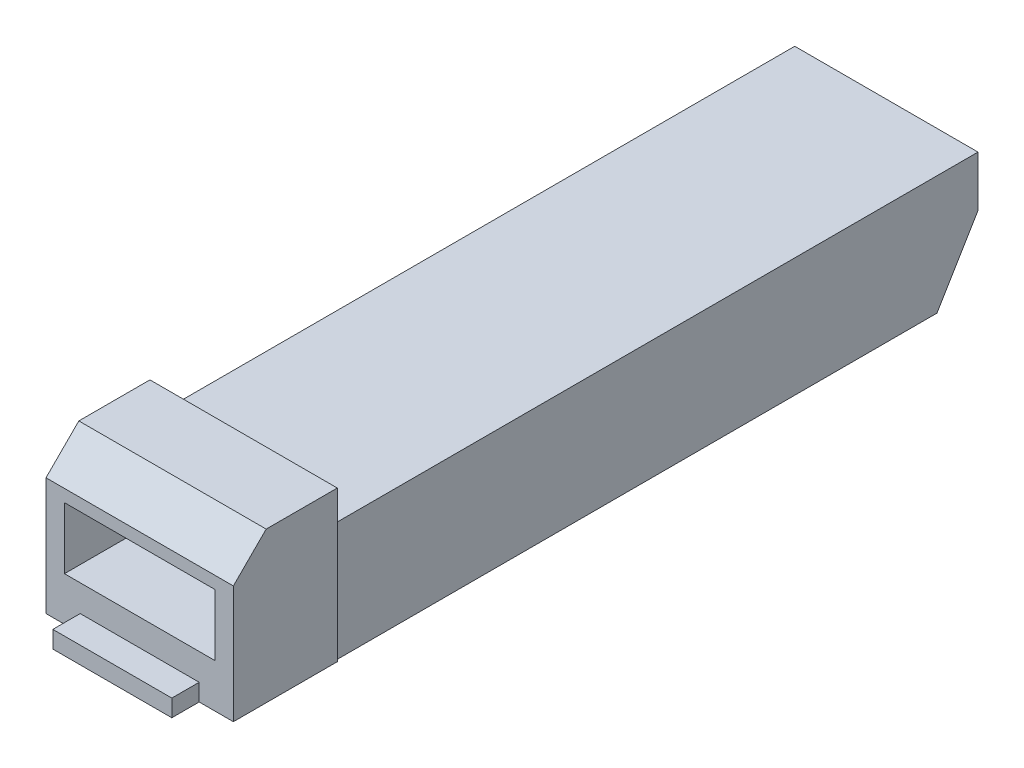
ISO-10303-21;
HEADER;
FILE_DESCRIPTION(('STEP AP214'),'2;1');
FILE_NAME('part.step','',(''),(''),'','','');
FILE_SCHEMA(('AUTOMOTIVE_DESIGN { 1 0 10303 214 1 1 1 1 }'));
ENDSEC;
DATA;
#1=APPLICATION_CONTEXT('core data for automotive mechanical design processes');
#2=APPLICATION_PROTOCOL_DEFINITION('international standard','automotive_design',2000,#1);
#3=PRODUCT_CONTEXT('',#1,'mechanical');
#4=PRODUCT('Part','Part','',(#3));
#5=PRODUCT_RELATED_PRODUCT_CATEGORY('part','',(#4));
#6=PRODUCT_DEFINITION_FORMATION('','',#4);
#7=PRODUCT_DEFINITION_CONTEXT('part definition',#1,'design');
#8=PRODUCT_DEFINITION('design','',#6,#7);
#9=PRODUCT_DEFINITION_SHAPE('','',#8);
#10=(LENGTH_UNIT() NAMED_UNIT(*) SI_UNIT(.MILLI.,.METRE.));
#11=(NAMED_UNIT(*) PLANE_ANGLE_UNIT() SI_UNIT($,.RADIAN.));
#12=(NAMED_UNIT(*) SI_UNIT($,.STERADIAN.) SOLID_ANGLE_UNIT());
#13=UNCERTAINTY_MEASURE_WITH_UNIT(LENGTH_MEASURE(1.E-05),#10,'distance_accuracy_value','');
#14=(GEOMETRIC_REPRESENTATION_CONTEXT(3) GLOBAL_UNCERTAINTY_ASSIGNED_CONTEXT((#13)) GLOBAL_UNIT_ASSIGNED_CONTEXT((#10,
#11,#12)) REPRESENTATION_CONTEXT('',''));
#15=CARTESIAN_POINT('',(0.,0.,0.));
#16=DIRECTION('',(0.,0.,1.));
#17=DIRECTION('',(1.,0.,0.));
#18=AXIS2_PLACEMENT_3D('',#15,#16,#17);
#19=CARTESIAN_POINT('',(4.35,0.,39.6297865460114));
#20=DIRECTION('',(-1.,0.,0.));
#21=DIRECTION('',(0.,0.,1.));
#22=AXIS2_PLACEMENT_3D('',#19,#20,#21);
#23=PLANE('',#22);
#24=DIRECTION('',(0.,1.,0.));
#25=VECTOR('',#24,1.);
#26=CARTESIAN_POINT('',(4.35,0.,37.6297865460114));
#27=LINE('',#26,#25);
#28=CARTESIAN_POINT('',(4.35,0.,37.6297865460114));
#29=VERTEX_POINT('',#28);
#30=CARTESIAN_POINT('',(4.35,1.25,37.6297865460114));
#31=VERTEX_POINT('',#30);
#32=EDGE_CURVE('E105',#29,#31,#27,.T.);
#33=ORIENTED_EDGE('',*,*,#32,.T.);
#34=DIRECTION('',(0.,0.,-1.));
#35=VECTOR('',#34,1.);
#36=CARTESIAN_POINT('',(4.35,1.25,39.6297865460114));
#37=LINE('',#36,#35);
#38=CARTESIAN_POINT('',(4.35,1.25,39.6297865460114));
#39=VERTEX_POINT('',#38);
#40=EDGE_CURVE('E12',#39,#31,#37,.T.);
#41=ORIENTED_EDGE('',*,*,#40,.F.);
#42=DIRECTION('',(0.,1.,0.));
#43=VECTOR('',#42,1.);
#44=CARTESIAN_POINT('',(4.35,0.,39.6297865460114));
#45=LINE('',#44,#43);
#46=CARTESIAN_POINT('',(4.35,0.,39.6297865460114));
#47=VERTEX_POINT('',#46);
#48=EDGE_CURVE('E93',#47,#39,#45,.T.);
#49=ORIENTED_EDGE('',*,*,#48,.F.);
#50=DIRECTION('',(0.,0.,-1.));
#51=VECTOR('',#50,1.);
#52=CARTESIAN_POINT('',(4.35,0.,39.6297865460114));
#53=LINE('',#52,#51);
#54=EDGE_CURVE('E101',#47,#29,#53,.T.);
#55=ORIENTED_EDGE('',*,*,#54,.T.);
#56=EDGE_LOOP('',(#33,#41,#49,#55));
#57=FACE_BOUND('',#56,.T.);
#58=ADVANCED_FACE('F42',(#57),#23,.F.);
#59=CARTESIAN_POINT('',(4.35,1.25,39.6297865460114));
#60=DIRECTION('',(0.,-1.,0.));
#61=DIRECTION('',(0.,0.,-1.));
#62=AXIS2_PLACEMENT_3D('',#59,#60,#61);
#63=PLANE('',#62);
#64=DIRECTION('',(-1.,0.,0.));
#65=VECTOR('',#64,1.);
#66=CARTESIAN_POINT('',(4.35,1.25,37.6297865460114));
#67=LINE('',#66,#65);
#68=CARTESIAN_POINT('',(-4.35,1.25,37.6297865460114));
#69=VERTEX_POINT('',#68);
#70=EDGE_CURVE('E97',#31,#69,#67,.T.);
#71=ORIENTED_EDGE('',*,*,#70,.T.);
#72=DIRECTION('',(0.,0.,-1.));
#73=VECTOR('',#72,1.);
#74=CARTESIAN_POINT('',(-4.35,1.25,39.6297865460114));
#75=LINE('',#74,#73);
#76=CARTESIAN_POINT('',(-4.35,1.25,39.6297865460114));
#77=VERTEX_POINT('',#76);
#78=EDGE_CURVE('E50',#77,#69,#75,.T.);
#79=ORIENTED_EDGE('',*,*,#78,.F.);
#80=DIRECTION('',(-1.,0.,0.));
#81=VECTOR('',#80,1.);
#82=CARTESIAN_POINT('',(4.35,1.25,39.6297865460114));
#83=LINE('',#82,#81);
#84=EDGE_CURVE('E88',#39,#77,#83,.T.);
#85=ORIENTED_EDGE('',*,*,#84,.F.);
#86=ORIENTED_EDGE('',*,*,#40,.T.);
#87=EDGE_LOOP('',(#71,#79,#85,#86));
#88=FACE_BOUND('',#87,.T.);
#89=ADVANCED_FACE('F96',(#88),#63,.F.);
#90=CARTESIAN_POINT('',(-4.35,0.,39.6297865460114));
#91=DIRECTION('',(1.,0.,0.));
#92=DIRECTION('',(0.,0.,-1.));
#93=AXIS2_PLACEMENT_3D('',#90,#91,#92);
#94=PLANE('',#93);
#95=DIRECTION('',(0.,-1.,0.));
#96=VECTOR('',#95,1.);
#97=CARTESIAN_POINT('',(-4.35,0.,37.6297865460114));
#98=LINE('',#97,#96);
#99=CARTESIAN_POINT('',(-4.35,0.,37.6297865460114));
#100=VERTEX_POINT('',#99);
#101=EDGE_CURVE('E75',#69,#100,#98,.T.);
#102=ORIENTED_EDGE('',*,*,#101,.T.);
#103=DIRECTION('',(0.,0.,-1.));
#104=VECTOR('',#103,1.);
#105=CARTESIAN_POINT('',(-4.35,0.,39.6297865460114));
#106=LINE('',#105,#104);
#107=CARTESIAN_POINT('',(-4.35,0.,39.6297865460114));
#108=VERTEX_POINT('',#107);
#109=EDGE_CURVE('E98',#108,#100,#106,.T.);
#110=ORIENTED_EDGE('',*,*,#109,.F.);
#111=DIRECTION('',(0.,-1.,0.));
#112=VECTOR('',#111,1.);
#113=CARTESIAN_POINT('',(-4.35,0.,39.6297865460114));
#114=LINE('',#113,#112);
#115=EDGE_CURVE('E91',#77,#108,#114,.T.);
#116=ORIENTED_EDGE('',*,*,#115,.F.);
#117=ORIENTED_EDGE('',*,*,#78,.T.);
#118=EDGE_LOOP('',(#102,#110,#116,#117));
#119=FACE_BOUND('',#118,.T.);
#120=ADVANCED_FACE('F99',(#119),#94,.F.);
#121=CARTESIAN_POINT('',(4.35,0.,39.6297865460114));
#122=DIRECTION('',(0.,1.,0.));
#123=DIRECTION('',(0.,0.,1.));
#124=AXIS2_PLACEMENT_3D('',#121,#122,#123);
#125=PLANE('',#124);
#126=DIRECTION('',(1.,0.,0.));
#127=VECTOR('',#126,1.);
#128=CARTESIAN_POINT('',(4.35,0.,37.6297865460114));
#129=LINE('',#128,#127);
#130=EDGE_CURVE('E81',#100,#29,#129,.T.);
#131=ORIENTED_EDGE('',*,*,#130,.T.);
#132=ORIENTED_EDGE('',*,*,#54,.F.);
#133=DIRECTION('',(1.,0.,0.));
#134=VECTOR('',#133,1.);
#135=CARTESIAN_POINT('',(4.35,0.,39.6297865460114));
#136=LINE('',#135,#134);
#137=EDGE_CURVE('E58',#108,#47,#136,.T.);
#138=ORIENTED_EDGE('',*,*,#137,.F.);
#139=ORIENTED_EDGE('',*,*,#109,.T.);
#140=EDGE_LOOP('',(#131,#132,#138,#139));
#141=FACE_BOUND('',#140,.T.);
#142=ADVANCED_FACE('F112',(#141),#125,.F.);
#143=CARTESIAN_POINT('',(0.,0.,39.6297865460114));
#144=DIRECTION('',(0.,0.,1.));
#145=DIRECTION('',(1.,0.,0.));
#146=AXIS2_PLACEMENT_3D('',#143,#144,#145);
#147=PLANE('',#146);
#148=ORIENTED_EDGE('',*,*,#48,.T.);
#149=ORIENTED_EDGE('',*,*,#84,.T.);
#150=ORIENTED_EDGE('',*,*,#115,.T.);
#151=ORIENTED_EDGE('',*,*,#137,.T.);
#152=EDGE_LOOP('',(#148,#149,#150,#151));
#153=FACE_BOUND('',#152,.T.);
#154=ADVANCED_FACE('F89',(#153),#147,.T.);
#155=CARTESIAN_POINT('',(0.,0.,37.6297865460114));
#156=DIRECTION('',(0.,0.,1.));
#157=DIRECTION('',(1.,0.,0.));
#158=AXIS2_PLACEMENT_3D('',#155,#156,#157);
#159=PLANE('',#158);
#160=ORIENTED_EDGE('',*,*,#32,.F.);
#161=ORIENTED_EDGE('',*,*,#130,.F.);
#162=ORIENTED_EDGE('',*,*,#101,.F.);
#163=ORIENTED_EDGE('',*,*,#70,.F.);
#164=EDGE_LOOP('',(#160,#161,#162,#163));
#165=FACE_BOUND('',#164,.T.);
#166=ADVANCED_FACE('F115',(#165),#159,.F.);
#167=CLOSED_SHELL('',(#58,#89,#120,#142,#154,#166));
#168=MANIFOLD_SOLID_BREP('B2',#167);
#169=CARTESIAN_POINT('',(-6.70000000000001,8.7,-16.9702134539886));
#170=DIRECTION('',(1.,0.,0.));
#171=DIRECTION('',(0.,0.,-1.));
#172=AXIS2_PLACEMENT_3D('',#169,#170,#171);
#173=PLANE('',#172);
#174=DIRECTION('',(0.,-1.,0.));
#175=VECTOR('',#174,1.);
#176=CARTESIAN_POINT('',(-6.70000000000001,8.7,-16.9702134539886));
#177=LINE('',#176,#175);
#178=CARTESIAN_POINT('',(-6.70000000000001,8.7,-16.9702134539886));
#179=VERTEX_POINT('',#178);
#180=CARTESIAN_POINT('',(-6.7,5.,-16.9702134539886));
#181=VERTEX_POINT('',#180);
#182=EDGE_CURVE('E388',#179,#181,#177,.T.);
#183=ORIENTED_EDGE('',*,*,#182,.T.);
#184=DIRECTION('',(0.,0.857492925712544,-0.514495755427526));
#185=VECTOR('',#184,1.);
#186=CARTESIAN_POINT('',(-6.7,0.,-13.9702134539886));
#187=LINE('',#186,#185);
#188=CARTESIAN_POINT('',(-6.7,0.,-13.9702134539886));
#189=VERTEX_POINT('',#188);
#190=EDGE_CURVE('E333',#189,#181,#187,.T.);
#191=ORIENTED_EDGE('',*,*,#190,.F.);
#192=DIRECTION('',(0.,0.,1.));
#193=VECTOR('',#192,1.);
#194=CARTESIAN_POINT('',(-6.70000000000001,0.,-16.9702134539886));
#195=LINE('',#194,#193);
#196=CARTESIAN_POINT('',(-6.7,0.,30.0297865460114));
#197=VERTEX_POINT('',#196);
#198=EDGE_CURVE('E367',#189,#197,#195,.T.);
#199=ORIENTED_EDGE('',*,*,#198,.T.);
#200=DIRECTION('',(0.,-1.,0.));
#201=VECTOR('',#200,1.);
#202=CARTESIAN_POINT('',(-6.7,8.7,30.0297865460114));
#203=LINE('',#202,#201);
#204=CARTESIAN_POINT('',(-6.7,8.7,30.0297865460114));
#205=VERTEX_POINT('',#204);
#206=EDGE_CURVE('E172',#205,#197,#203,.T.);
#207=ORIENTED_EDGE('',*,*,#206,.F.);
#208=DIRECTION('',(0.,0.,1.));
#209=VECTOR('',#208,1.);
#210=CARTESIAN_POINT('',(-6.70000000000001,8.7,-16.9702134539886));
#211=LINE('',#210,#209);
#212=EDGE_CURVE('E366',#179,#205,#211,.T.);
#213=ORIENTED_EDGE('',*,*,#212,.F.);
#214=EDGE_LOOP('',(#183,#191,#199,#207,#213));
#215=FACE_BOUND('',#214,.T.);
#216=ADVANCED_FACE('F165',(#215),#173,.F.);
#217=CARTESIAN_POINT('',(6.69999999999999,8.7,-16.9702134539886));
#218=DIRECTION('',(-1.,0.,0.));
#219=DIRECTION('',(0.,0.,1.));
#220=AXIS2_PLACEMENT_3D('',#217,#218,#219);
#221=PLANE('',#220);
#222=DIRECTION('',(0.,0.,-1.));
#223=VECTOR('',#222,1.);
#224=CARTESIAN_POINT('',(6.69999999999999,0.,-16.9702134539886));
#225=LINE('',#224,#223);
#226=CARTESIAN_POINT('',(6.7,0.,30.0297865460114));
#227=VERTEX_POINT('',#226);
#228=CARTESIAN_POINT('',(6.69999999999999,0.,-13.9702134539886));
#229=VERTEX_POINT('',#228);
#230=EDGE_CURVE('E362',#227,#229,#225,.T.);
#231=ORIENTED_EDGE('',*,*,#230,.T.);
#232=DIRECTION('',(0.,0.857492925712544,-0.514495755427526));
#233=VECTOR('',#232,1.);
#234=CARTESIAN_POINT('',(6.7,0.,-13.9702134539886));
#235=LINE('',#234,#233);
#236=CARTESIAN_POINT('',(6.7,5.,-16.9702134539886));
#237=VERTEX_POINT('',#236);
#238=EDGE_CURVE('E397',#229,#237,#235,.T.);
#239=ORIENTED_EDGE('',*,*,#238,.T.);
#240=DIRECTION('',(0.,-1.,0.));
#241=VECTOR('',#240,1.);
#242=CARTESIAN_POINT('',(6.69999999999999,8.7,-16.9702134539886));
#243=LINE('',#242,#241);
#244=CARTESIAN_POINT('',(6.69999999999999,8.7,-16.9702134539886));
#245=VERTEX_POINT('',#244);
#246=EDGE_CURVE('E379',#245,#237,#243,.T.);
#247=ORIENTED_EDGE('',*,*,#246,.F.);
#248=DIRECTION('',(0.,0.,-1.));
#249=VECTOR('',#248,1.);
#250=CARTESIAN_POINT('',(6.69999999999999,8.7,-16.9702134539886));
#251=LINE('',#250,#249);
#252=CARTESIAN_POINT('',(6.7,8.7,30.0297865460114));
#253=VERTEX_POINT('',#252);
#254=EDGE_CURVE('E393',#253,#245,#251,.T.);
#255=ORIENTED_EDGE('',*,*,#254,.F.);
#256=DIRECTION('',(0.,-1.,0.));
#257=VECTOR('',#256,1.);
#258=CARTESIAN_POINT('',(6.7,8.7,30.0297865460114));
#259=LINE('',#258,#257);
#260=EDGE_CURVE('E377',#253,#227,#259,.T.);
#261=ORIENTED_EDGE('',*,*,#260,.T.);
#262=EDGE_LOOP('',(#231,#239,#247,#255,#261));
#263=FACE_BOUND('',#262,.T.);
#264=ADVANCED_FACE('F401',(#263),#221,.F.);
#265=CARTESIAN_POINT('',(-6.70000000000001,8.7,-16.9702134539886));
#266=DIRECTION('',(0.,0.,1.));
#267=DIRECTION('',(1.,0.,0.));
#268=AXIS2_PLACEMENT_3D('',#265,#266,#267);
#269=PLANE('',#268);
#270=ORIENTED_EDGE('',*,*,#246,.T.);
#271=DIRECTION('',(-1.,0.,0.));
#272=VECTOR('',#271,1.);
#273=CARTESIAN_POINT('',(6.7,5.,-16.9702134539886));
#274=LINE('',#273,#272);
#275=EDGE_CURVE('E371',#237,#181,#274,.T.);
#276=ORIENTED_EDGE('',*,*,#275,.T.);
#277=ORIENTED_EDGE('',*,*,#182,.F.);
#278=DIRECTION('',(-1.,0.,0.));
#279=VECTOR('',#278,1.);
#280=CARTESIAN_POINT('',(-6.70000000000001,8.7,-16.9702134539886));
#281=LINE('',#280,#279);
#282=EDGE_CURVE('E391',#245,#179,#281,.T.);
#283=ORIENTED_EDGE('',*,*,#282,.F.);
#284=EDGE_LOOP('',(#270,#276,#277,#283));
#285=FACE_BOUND('',#284,.T.);
#286=ADVANCED_FACE('F406',(#285),#269,.F.);
#287=CARTESIAN_POINT('',(0.,8.7,0.));
#288=DIRECTION('',(0.,1.,0.));
#289=DIRECTION('',(0.,0.,1.));
#290=AXIS2_PLACEMENT_3D('',#287,#288,#289);
#291=PLANE('',#290);
#292=ORIENTED_EDGE('',*,*,#212,.T.);
#293=DIRECTION('',(1.,0.,0.));
#294=VECTOR('',#293,1.);
#295=CARTESIAN_POINT('',(-6.7,8.7,30.0297865460114));
#296=LINE('',#295,#294);
#297=EDGE_CURVE('E369',#205,#253,#296,.T.);
#298=ORIENTED_EDGE('',*,*,#297,.T.);
#299=ORIENTED_EDGE('',*,*,#254,.T.);
#300=ORIENTED_EDGE('',*,*,#282,.T.);
#301=EDGE_LOOP('',(#292,#298,#299,#300));
#302=FACE_BOUND('',#301,.T.);
#303=ADVANCED_FACE('F410',(#302),#291,.T.);
#304=CARTESIAN_POINT('',(0.,0.,0.));
#305=DIRECTION('',(0.,1.,0.));
#306=DIRECTION('',(0.,0.,1.));
#307=AXIS2_PLACEMENT_3D('',#304,#305,#306);
#308=PLANE('',#307);
#309=ORIENTED_EDGE('',*,*,#198,.F.);
#310=DIRECTION('',(-1.,0.,0.));
#311=VECTOR('',#310,1.);
#312=CARTESIAN_POINT('',(6.7,0.,-13.9702134539886));
#313=LINE('',#312,#311);
#314=EDGE_CURVE('E363',#229,#189,#313,.T.);
#315=ORIENTED_EDGE('',*,*,#314,.F.);
#316=ORIENTED_EDGE('',*,*,#230,.F.);
#317=DIRECTION('',(1.,0.,0.));
#318=VECTOR('',#317,1.);
#319=CARTESIAN_POINT('',(-6.85,0.,30.0297865460114));
#320=LINE('',#319,#318);
#321=CARTESIAN_POINT('',(6.85,0.,30.0297865460114));
#322=VERTEX_POINT('',#321);
#323=EDGE_CURVE('E318',#227,#322,#320,.T.);
#324=ORIENTED_EDGE('',*,*,#323,.T.);
#325=DIRECTION('',(0.,0.,-1.));
#326=VECTOR('',#325,1.);
#327=CARTESIAN_POINT('',(6.85,0.,37.6297865460114));
#328=LINE('',#327,#326);
#329=CARTESIAN_POINT('',(6.85,0.,37.6297865460114));
#330=VERTEX_POINT('',#329);
#331=EDGE_CURVE('E334',#330,#322,#328,.T.);
#332=ORIENTED_EDGE('',*,*,#331,.F.);
#333=DIRECTION('',(1.,0.,0.));
#334=VECTOR('',#333,1.);
#335=CARTESIAN_POINT('',(-6.85,0.,37.6297865460114));
#336=LINE('',#335,#334);
#337=CARTESIAN_POINT('',(-6.85,0.,37.6297865460114));
#338=VERTEX_POINT('',#337);
#339=EDGE_CURVE('E309',#338,#330,#336,.T.);
#340=ORIENTED_EDGE('',*,*,#339,.F.);
#341=DIRECTION('',(0.,0.,-1.));
#342=VECTOR('',#341,1.);
#343=CARTESIAN_POINT('',(-6.85,0.,37.6297865460114));
#344=LINE('',#343,#342);
#345=CARTESIAN_POINT('',(-6.85,0.,30.0297865460114));
#346=VERTEX_POINT('',#345);
#347=EDGE_CURVE('E330',#338,#346,#344,.T.);
#348=ORIENTED_EDGE('',*,*,#347,.T.);
#349=EDGE_CURVE('E327',#346,#197,#320,.T.);
#350=ORIENTED_EDGE('',*,*,#349,.T.);
#351=EDGE_LOOP('',(#309,#315,#316,#324,#332,#340,#348,#350));
#352=FACE_BOUND('',#351,.T.);
#353=ADVANCED_FACE('F357',(#352),#308,.F.);
#354=CARTESIAN_POINT('',(6.7,0.,-13.9702134539886));
#355=DIRECTION('',(0.,0.514495755427526,0.857492925712544));
#356=DIRECTION('',(0.,-0.857492925712544,0.514495755427526));
#357=AXIS2_PLACEMENT_3D('',#354,#355,#356);
#358=PLANE('',#357);
#359=ORIENTED_EDGE('',*,*,#190,.T.);
#360=ORIENTED_EDGE('',*,*,#275,.F.);
#361=ORIENTED_EDGE('',*,*,#238,.F.);
#362=ORIENTED_EDGE('',*,*,#314,.T.);
#363=EDGE_LOOP('',(#359,#360,#361,#362));
#364=FACE_BOUND('',#363,.T.);
#365=ADVANCED_FACE('F439',(#364),#358,.F.);
#366=CARTESIAN_POINT('',(-6.85,11.,37.6297865460114));
#367=DIRECTION('',(1.,0.,0.));
#368=DIRECTION('',(0.,0.,-1.));
#369=AXIS2_PLACEMENT_3D('',#366,#367,#368);
#370=PLANE('',#369);
#371=DIRECTION('',(0.,-1.,0.));
#372=VECTOR('',#371,1.);
#373=CARTESIAN_POINT('',(-6.85,11.,37.6297865460114));
#374=LINE('',#373,#372);
#375=CARTESIAN_POINT('',(-6.85,8.6,37.6297865460114));
#376=VERTEX_POINT('',#375);
#377=EDGE_CURVE('E307',#376,#338,#374,.T.);
#378=ORIENTED_EDGE('',*,*,#377,.F.);
#379=DIRECTION('',(0.,-0.707106781186547,0.707106781186547));
#380=VECTOR('',#379,1.);
#381=CARTESIAN_POINT('',(-6.85,8.6,37.6297865460114));
#382=LINE('',#381,#380);
#383=CARTESIAN_POINT('',(-6.85,11.,35.2297865460114));
#384=VERTEX_POINT('',#383);
#385=EDGE_CURVE('E186',#384,#376,#382,.T.);
#386=ORIENTED_EDGE('',*,*,#385,.F.);
#387=DIRECTION('',(0.,0.,-1.));
#388=VECTOR('',#387,1.);
#389=CARTESIAN_POINT('',(-6.85,11.,37.6297865460114));
#390=LINE('',#389,#388);
#391=CARTESIAN_POINT('',(-6.85,11.,30.0297865460114));
#392=VERTEX_POINT('',#391);
#393=EDGE_CURVE('E315',#384,#392,#390,.T.);
#394=ORIENTED_EDGE('',*,*,#393,.T.);
#395=DIRECTION('',(0.,-1.,0.));
#396=VECTOR('',#395,1.);
#397=CARTESIAN_POINT('',(-6.85,11.,30.0297865460114));
#398=LINE('',#397,#396);
#399=EDGE_CURVE('E306',#392,#346,#398,.T.);
#400=ORIENTED_EDGE('',*,*,#399,.T.);
#401=ORIENTED_EDGE('',*,*,#347,.F.);
#402=EDGE_LOOP('',(#378,#386,#394,#400,#401));
#403=FACE_BOUND('',#402,.T.);
#404=ADVANCED_FACE('F416',(#403),#370,.F.);
#405=CARTESIAN_POINT('',(6.85,11.,37.6297865460114));
#406=DIRECTION('',(1.,0.,0.));
#407=DIRECTION('',(0.,1.,0.));
#408=AXIS2_PLACEMENT_3D('',#405,#406,#407);
#409=PLANE('',#408);
#410=DIRECTION('',(0.,0.707106781186547,-0.707106781186547));
#411=VECTOR('',#410,1.);
#412=CARTESIAN_POINT('',(6.85,9.8,36.4297865460114));
#413=LINE('',#412,#411);
#414=CARTESIAN_POINT('',(6.85,8.6,37.6297865460114));
#415=VERTEX_POINT('',#414);
#416=CARTESIAN_POINT('',(6.85,11.,35.2297865460114));
#417=VERTEX_POINT('',#416);
#418=EDGE_CURVE('E304',#415,#417,#413,.T.);
#419=ORIENTED_EDGE('',*,*,#418,.F.);
#420=DIRECTION('',(0.,-1.,0.));
#421=VECTOR('',#420,1.);
#422=CARTESIAN_POINT('',(6.85,11.,37.6297865460114));
#423=LINE('',#422,#421);
#424=EDGE_CURVE('E313',#415,#330,#423,.T.);
#425=ORIENTED_EDGE('',*,*,#424,.T.);
#426=ORIENTED_EDGE('',*,*,#331,.T.);
#427=DIRECTION('',(0.,-1.,0.));
#428=VECTOR('',#427,1.);
#429=CARTESIAN_POINT('',(6.85,11.,30.0297865460114));
#430=LINE('',#429,#428);
#431=CARTESIAN_POINT('',(6.85,11.,30.0297865460114));
#432=VERTEX_POINT('',#431);
#433=EDGE_CURVE('E321',#432,#322,#430,.T.);
#434=ORIENTED_EDGE('',*,*,#433,.F.);
#435=DIRECTION('',(0.,0.,-1.));
#436=VECTOR('',#435,1.);
#437=CARTESIAN_POINT('',(6.85,11.,37.6297865460114));
#438=LINE('',#437,#436);
#439=EDGE_CURVE('E337',#417,#432,#438,.T.);
#440=ORIENTED_EDGE('',*,*,#439,.F.);
#441=EDGE_LOOP('',(#419,#425,#426,#434,#440));
#442=FACE_BOUND('',#441,.T.);
#443=ADVANCED_FACE('F351',(#442),#409,.T.);
#444=CARTESIAN_POINT('',(-6.85,11.,37.6297865460114));
#445=DIRECTION('',(0.,1.,0.));
#446=DIRECTION('',(0.,0.,1.));
#447=AXIS2_PLACEMENT_3D('',#444,#445,#446);
#448=PLANE('',#447);
#449=DIRECTION('',(-1.,0.,0.));
#450=VECTOR('',#449,1.);
#451=CARTESIAN_POINT('',(6.850025,11.,35.2297865460114));
#452=LINE('',#451,#450);
#453=EDGE_CURVE('E302',#417,#384,#452,.T.);
#454=ORIENTED_EDGE('',*,*,#453,.F.);
#455=ORIENTED_EDGE('',*,*,#439,.T.);
#456=DIRECTION('',(1.,0.,0.));
#457=VECTOR('',#456,1.);
#458=CARTESIAN_POINT('',(-6.85,11.,30.0297865460114));
#459=LINE('',#458,#457);
#460=EDGE_CURVE('E310',#392,#432,#459,.T.);
#461=ORIENTED_EDGE('',*,*,#460,.F.);
#462=ORIENTED_EDGE('',*,*,#393,.F.);
#463=EDGE_LOOP('',(#454,#455,#461,#462));
#464=FACE_BOUND('',#463,.T.);
#465=ADVANCED_FACE('F420',(#464),#448,.T.);
#466=CARTESIAN_POINT('',(0.,0.,37.6297865460114));
#467=DIRECTION('',(0.,0.,1.));
#468=DIRECTION('',(1.,0.,0.));
#469=AXIS2_PLACEMENT_3D('',#466,#467,#468);
#470=PLANE('',#469);
#471=DIRECTION('',(0.,-1.,0.));
#472=VECTOR('',#471,1.);
#473=CARTESIAN_POINT('',(-5.5,7.7,37.6297865460114));
#474=LINE('',#473,#472);
#475=CARTESIAN_POINT('',(-5.5,7.7,37.6297865460114));
#476=VERTEX_POINT('',#475);
#477=CARTESIAN_POINT('',(-5.5,3.2,37.6297865460114));
#478=VERTEX_POINT('',#477);
#479=EDGE_CURVE('E179',#476,#478,#474,.T.);
#480=ORIENTED_EDGE('',*,*,#479,.F.);
#481=DIRECTION('',(1.,0.,0.));
#482=VECTOR('',#481,1.);
#483=CARTESIAN_POINT('',(-5.5,7.7,37.6297865460114));
#484=LINE('',#483,#482);
#485=CARTESIAN_POINT('',(5.5,7.7,37.6297865460114));
#486=VERTEX_POINT('',#485);
#487=EDGE_CURVE('E283',#476,#486,#484,.T.);
#488=ORIENTED_EDGE('',*,*,#487,.T.);
#489=DIRECTION('',(0.,-1.,0.));
#490=VECTOR('',#489,1.);
#491=CARTESIAN_POINT('',(5.5,7.7,37.6297865460114));
#492=LINE('',#491,#490);
#493=CARTESIAN_POINT('',(5.5,3.2,37.6297865460114));
#494=VERTEX_POINT('',#493);
#495=EDGE_CURVE('E286',#486,#494,#492,.T.);
#496=ORIENTED_EDGE('',*,*,#495,.T.);
#497=DIRECTION('',(1.,0.,0.));
#498=VECTOR('',#497,1.);
#499=CARTESIAN_POINT('',(-5.5,3.2,37.6297865460114));
#500=LINE('',#499,#498);
#501=EDGE_CURVE('E292',#478,#494,#500,.T.);
#502=ORIENTED_EDGE('',*,*,#501,.F.);
#503=EDGE_LOOP('',(#480,#488,#496,#502));
#504=FACE_BOUND('',#503,.T.);
#505=DIRECTION('',(1.,0.,0.));
#506=VECTOR('',#505,1.);
#507=CARTESIAN_POINT('',(0.,8.6,37.6297865460114));
#508=LINE('',#507,#506);
#509=EDGE_CURVE('E40',#376,#415,#508,.T.);
#510=ORIENTED_EDGE('',*,*,#509,.F.);
#511=ORIENTED_EDGE('',*,*,#377,.T.);
#512=ORIENTED_EDGE('',*,*,#339,.T.);
#513=ORIENTED_EDGE('',*,*,#424,.F.);
#514=EDGE_LOOP('',(#510,#511,#512,#513));
#515=FACE_BOUND('',#514,.T.);
#516=ADVANCED_FACE('F423',(#504,#515),#470,.T.);
#517=CARTESIAN_POINT('',(0.,0.,30.0297865460114));
#518=DIRECTION('',(0.,0.,1.));
#519=DIRECTION('',(1.,0.,0.));
#520=AXIS2_PLACEMENT_3D('',#517,#518,#519);
#521=PLANE('',#520);
#522=ORIENTED_EDGE('',*,*,#260,.F.);
#523=ORIENTED_EDGE('',*,*,#297,.F.);
#524=ORIENTED_EDGE('',*,*,#206,.T.);
#525=ORIENTED_EDGE('',*,*,#349,.F.);
#526=ORIENTED_EDGE('',*,*,#399,.F.);
#527=ORIENTED_EDGE('',*,*,#460,.T.);
#528=ORIENTED_EDGE('',*,*,#433,.T.);
#529=ORIENTED_EDGE('',*,*,#323,.F.);
#530=EDGE_LOOP('',(#522,#523,#524,#525,#526,#527,#528,#529));
#531=FACE_BOUND('',#530,.T.);
#532=ADVANCED_FACE('F347',(#531),#521,.F.);
#533=CARTESIAN_POINT('',(6.850025,8.6,37.6297865460114));
#534=DIRECTION('',(0.,-0.707106781186547,-0.707106781186547));
#535=DIRECTION('',(0.,0.707106781186548,-0.707106781186548));
#536=AXIS2_PLACEMENT_3D('',#533,#534,#535);
#537=PLANE('',#536);
#538=ORIENTED_EDGE('',*,*,#418,.T.);
#539=ORIENTED_EDGE('',*,*,#453,.T.);
#540=ORIENTED_EDGE('',*,*,#385,.T.);
#541=ORIENTED_EDGE('',*,*,#509,.T.);
#542=EDGE_LOOP('',(#538,#539,#540,#541));
#543=FACE_BOUND('',#542,.T.);
#544=ADVANCED_FACE('F421',(#543),#537,.F.);
#545=CARTESIAN_POINT('',(-5.5,7.7,28.1297865460114));
#546=DIRECTION('',(-1.,0.,0.));
#547=DIRECTION('',(0.,0.,1.));
#548=AXIS2_PLACEMENT_3D('',#545,#546,#547);
#549=PLANE('',#548);
#550=ORIENTED_EDGE('',*,*,#479,.T.);
#551=DIRECTION('',(0.,0.,1.));
#552=VECTOR('',#551,1.);
#553=CARTESIAN_POINT('',(-5.5,3.2,28.1297865460114));
#554=LINE('',#553,#552);
#555=CARTESIAN_POINT('',(-5.5,3.2,28.1297865460114));
#556=VERTEX_POINT('',#555);
#557=EDGE_CURVE('E262',#556,#478,#554,.T.);
#558=ORIENTED_EDGE('',*,*,#557,.F.);
#559=DIRECTION('',(0.,-1.,0.));
#560=VECTOR('',#559,1.);
#561=CARTESIAN_POINT('',(-5.5,7.7,28.1297865460114));
#562=LINE('',#561,#560);
#563=CARTESIAN_POINT('',(-5.5,7.7,28.1297865460114));
#564=VERTEX_POINT('',#563);
#565=EDGE_CURVE('E266',#564,#556,#562,.T.);
#566=ORIENTED_EDGE('',*,*,#565,.F.);
#567=DIRECTION('',(0.,0.,1.));
#568=VECTOR('',#567,1.);
#569=CARTESIAN_POINT('',(-5.5,7.7,28.1297865460114));
#570=LINE('',#569,#568);
#571=EDGE_CURVE('E296',#564,#476,#570,.T.);
#572=ORIENTED_EDGE('',*,*,#571,.T.);
#573=EDGE_LOOP('',(#550,#558,#566,#572));
#574=FACE_BOUND('',#573,.T.);
#575=ADVANCED_FACE('F264',(#574),#549,.F.);
#576=CARTESIAN_POINT('',(-5.5,7.7,28.1297865460114));
#577=DIRECTION('',(0.,-1.,0.));
#578=DIRECTION('',(0.,0.,-1.));
#579=AXIS2_PLACEMENT_3D('',#576,#577,#578);
#580=PLANE('',#579);
#581=ORIENTED_EDGE('',*,*,#487,.F.);
#582=ORIENTED_EDGE('',*,*,#571,.F.);
#583=DIRECTION('',(1.,0.,0.));
#584=VECTOR('',#583,1.);
#585=CARTESIAN_POINT('',(-5.5,7.7,28.1297865460114));
#586=LINE('',#585,#584);
#587=CARTESIAN_POINT('',(5.5,7.7,28.1297865460114));
#588=VERTEX_POINT('',#587);
#589=EDGE_CURVE('E271',#564,#588,#586,.T.);
#590=ORIENTED_EDGE('',*,*,#589,.T.);
#591=DIRECTION('',(0.,0.,1.));
#592=VECTOR('',#591,1.);
#593=CARTESIAN_POINT('',(5.5,7.7,28.1297865460114));
#594=LINE('',#593,#592);
#595=EDGE_CURVE('E298',#588,#486,#594,.T.);
#596=ORIENTED_EDGE('',*,*,#595,.T.);
#597=EDGE_LOOP('',(#581,#582,#590,#596));
#598=FACE_BOUND('',#597,.T.);
#599=ADVANCED_FACE('F512',(#598),#580,.T.);
#600=CARTESIAN_POINT('',(5.5,7.7,28.1297865460114));
#601=DIRECTION('',(-1.,0.,0.));
#602=DIRECTION('',(0.,0.,1.));
#603=AXIS2_PLACEMENT_3D('',#600,#601,#602);
#604=PLANE('',#603);
#605=ORIENTED_EDGE('',*,*,#495,.F.);
#606=ORIENTED_EDGE('',*,*,#595,.F.);
#607=DIRECTION('',(0.,-1.,0.));
#608=VECTOR('',#607,1.);
#609=CARTESIAN_POINT('',(5.5,7.7,28.1297865460114));
#610=LINE('',#609,#608);
#611=CARTESIAN_POINT('',(5.5,3.2,28.1297865460114));
#612=VERTEX_POINT('',#611);
#613=EDGE_CURVE('E279',#588,#612,#610,.T.);
#614=ORIENTED_EDGE('',*,*,#613,.T.);
#615=DIRECTION('',(0.,0.,1.));
#616=VECTOR('',#615,1.);
#617=CARTESIAN_POINT('',(5.5,3.2,28.1297865460114));
#618=LINE('',#617,#616);
#619=EDGE_CURVE('E270',#612,#494,#618,.T.);
#620=ORIENTED_EDGE('',*,*,#619,.T.);
#621=EDGE_LOOP('',(#605,#606,#614,#620));
#622=FACE_BOUND('',#621,.T.);
#623=ADVANCED_FACE('F521',(#622),#604,.T.);
#624=CARTESIAN_POINT('',(-5.5,3.2,28.1297865460114));
#625=DIRECTION('',(0.,-1.,0.));
#626=DIRECTION('',(0.,0.,-1.));
#627=AXIS2_PLACEMENT_3D('',#624,#625,#626);
#628=PLANE('',#627);
#629=ORIENTED_EDGE('',*,*,#501,.T.);
#630=ORIENTED_EDGE('',*,*,#619,.F.);
#631=DIRECTION('',(1.,0.,0.));
#632=VECTOR('',#631,1.);
#633=CARTESIAN_POINT('',(-5.5,3.2,28.1297865460114));
#634=LINE('',#633,#632);
#635=EDGE_CURVE('E275',#556,#612,#634,.T.);
#636=ORIENTED_EDGE('',*,*,#635,.F.);
#637=ORIENTED_EDGE('',*,*,#557,.T.);
#638=EDGE_LOOP('',(#629,#630,#636,#637));
#639=FACE_BOUND('',#638,.T.);
#640=ADVANCED_FACE('F276',(#639),#628,.F.);
#641=CARTESIAN_POINT('',(0.,0.,28.1297865460114));
#642=DIRECTION('',(0.,0.,1.));
#643=DIRECTION('',(1.,0.,0.));
#644=AXIS2_PLACEMENT_3D('',#641,#642,#643);
#645=PLANE('',#644);
#646=ORIENTED_EDGE('',*,*,#565,.T.);
#647=ORIENTED_EDGE('',*,*,#635,.T.);
#648=ORIENTED_EDGE('',*,*,#613,.F.);
#649=ORIENTED_EDGE('',*,*,#589,.F.);
#650=EDGE_LOOP('',(#646,#647,#648,#649));
#651=FACE_BOUND('',#650,.T.);
#652=ADVANCED_FACE('F282',(#651),#645,.T.);
#653=CLOSED_SHELL('',(#216,#264,#286,#303,#353,#365,#404,#443,#465,#516,#532,#544,#575,#599,
#623,#640,#652));
#654=MANIFOLD_SOLID_BREP('B6',#653);
#655=ADVANCED_BREP_SHAPE_REPRESENTATION('',(#18,#168,#654),#14);
#656=SHAPE_DEFINITION_REPRESENTATION(#9,#655);
ENDSEC;
END-ISO-10303-21;
